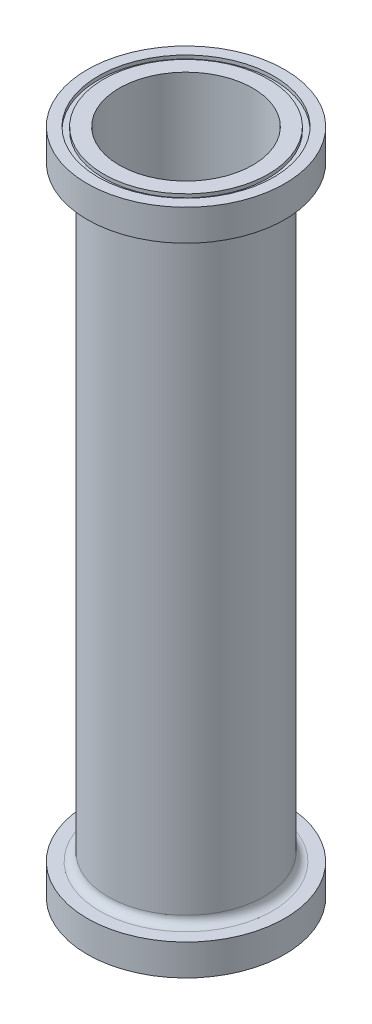
ISO-10303-21;
HEADER;
FILE_DESCRIPTION(('STEP AP214'),'2;1');
FILE_NAME('part.step','',(''),(''),'','','');
FILE_SCHEMA(('AUTOMOTIVE_DESIGN { 1 0 10303 214 1 1 1 1 }'));
ENDSEC;
DATA;
#1=APPLICATION_CONTEXT('core data for automotive mechanical design processes');
#2=APPLICATION_PROTOCOL_DEFINITION('international standard','automotive_design',2000,#1);
#3=PRODUCT_CONTEXT('',#1,'mechanical');
#4=PRODUCT('Part','Part','',(#3));
#5=PRODUCT_RELATED_PRODUCT_CATEGORY('part','',(#4));
#6=PRODUCT_DEFINITION_FORMATION('','',#4);
#7=PRODUCT_DEFINITION_CONTEXT('part definition',#1,'design');
#8=PRODUCT_DEFINITION('design','',#6,#7);
#9=PRODUCT_DEFINITION_SHAPE('','',#8);
#10=(LENGTH_UNIT() NAMED_UNIT(*) SI_UNIT(.MILLI.,.METRE.));
#11=(NAMED_UNIT(*) PLANE_ANGLE_UNIT() SI_UNIT($,.RADIAN.));
#12=(NAMED_UNIT(*) SI_UNIT($,.STERADIAN.) SOLID_ANGLE_UNIT());
#13=UNCERTAINTY_MEASURE_WITH_UNIT(LENGTH_MEASURE(1.E-05),#10,'distance_accuracy_value','');
#14=(GEOMETRIC_REPRESENTATION_CONTEXT(3) GLOBAL_UNCERTAINTY_ASSIGNED_CONTEXT((#13)) GLOBAL_UNIT_ASSIGNED_CONTEXT((#10,
#11,#12)) REPRESENTATION_CONTEXT('',''));
#15=CARTESIAN_POINT('',(0.,0.,0.));
#16=DIRECTION('',(0.,0.,1.));
#17=DIRECTION('',(1.,0.,0.));
#18=AXIS2_PLACEMENT_3D('',#15,#16,#17);
#19=CARTESIAN_POINT('',(0.,381.,0.));
#20=DIRECTION('',(0.,1.,0.));
#21=DIRECTION('',(0.,0.,1.));
#22=AXIS2_PLACEMENT_3D('',#19,#20,#21);
#23=PLANE('',#22);
#24=CARTESIAN_POINT('',(0.,381.,0.));
#25=DIRECTION('',(0.,1.,0.));
#26=DIRECTION('',(0.,0.,1.));
#27=AXIS2_PLACEMENT_3D('',#24,#25,#26);
#28=CIRCLE('',#27,38.1);
#29=CARTESIAN_POINT('',(0.,381.,38.1));
#30=VERTEX_POINT('',#29);
#31=EDGE_CURVE('E54',#30,#30,#28,.T.);
#32=ORIENTED_EDGE('',*,*,#31,.F.);
#33=EDGE_LOOP('',(#32));
#34=FACE_BOUND('',#33,.T.);
#35=CARTESIAN_POINT('',(0.,381.,0.));
#36=DIRECTION('',(0.,1.,0.));
#37=DIRECTION('',(0.,0.,1.));
#38=AXIS2_PLACEMENT_3D('',#35,#36,#37);
#39=CIRCLE('',#38,47.0027);
#40=CARTESIAN_POINT('',(0.,381.,47.0027));
#41=VERTEX_POINT('',#40);
#42=EDGE_CURVE('E91',#41,#41,#39,.T.);
#43=ORIENTED_EDGE('',*,*,#42,.T.);
#44=EDGE_LOOP('',(#43));
#45=FACE_BOUND('',#44,.T.);
#46=ADVANCED_FACE('F34',(#34,#45),#23,.T.);
#47=CARTESIAN_POINT('',(0.,0.,0.));
#48=DIRECTION('',(0.,1.,0.));
#49=DIRECTION('',(0.,0.,1.));
#50=AXIS2_PLACEMENT_3D('',#47,#48,#49);
#51=PLANE('',#50);
#52=CARTESIAN_POINT('',(0.,0.,0.));
#53=DIRECTION('',(0.,1.,0.));
#54=DIRECTION('',(0.,0.,1.));
#55=AXIS2_PLACEMENT_3D('',#52,#53,#54);
#56=CIRCLE('',#55,38.1);
#57=CARTESIAN_POINT('',(0.,0.,38.1));
#58=VERTEX_POINT('',#57);
#59=EDGE_CURVE('E55',#58,#58,#56,.T.);
#60=ORIENTED_EDGE('',*,*,#59,.T.);
#61=EDGE_LOOP('',(#60));
#62=FACE_BOUND('',#61,.T.);
#63=CARTESIAN_POINT('',(0.,0.,0.));
#64=DIRECTION('',(0.,-1.,0.));
#65=DIRECTION('',(0.,0.,-1.));
#66=AXIS2_PLACEMENT_3D('',#63,#64,#65);
#67=CIRCLE('',#66,47.0027);
#68=CARTESIAN_POINT('',(0.,0.,-47.0027));
#69=VERTEX_POINT('',#68);
#70=EDGE_CURVE('E79',#69,#69,#67,.T.);
#71=ORIENTED_EDGE('',*,*,#70,.T.);
#72=EDGE_LOOP('',(#71));
#73=FACE_BOUND('',#72,.T.);
#74=ADVANCED_FACE('F137',(#62,#73),#51,.F.);
#75=CARTESIAN_POINT('',(0.,381.,0.));
#76=DIRECTION('',(0.,-1.,0.));
#77=DIRECTION('',(0.,0.,-1.));
#78=AXIS2_PLACEMENT_3D('',#75,#76,#77);
#79=CYLINDRICAL_SURFACE('',#78,44.45);
#80=CARTESIAN_POINT('',(0.,22.5425,0.));
#81=DIRECTION('',(0.,-1.,0.));
#82=DIRECTION('',(0.,0.,-1.));
#83=AXIS2_PLACEMENT_3D('',#80,#81,#82);
#84=CIRCLE('',#83,44.45);
#85=CARTESIAN_POINT('',(0.,22.5425,-44.45));
#86=VERTEX_POINT('',#85);
#87=EDGE_CURVE('E41',#86,#86,#84,.F.);
#88=ORIENTED_EDGE('',*,*,#87,.T.);
#89=EDGE_LOOP('',(#88));
#90=FACE_BOUND('',#89,.T.);
#91=CARTESIAN_POINT('',(0.,358.4575,0.));
#92=DIRECTION('',(0.,1.,0.));
#93=DIRECTION('',(0.,0.,1.));
#94=AXIS2_PLACEMENT_3D('',#91,#92,#93);
#95=CIRCLE('',#94,44.45);
#96=CARTESIAN_POINT('',(0.,358.4575,44.45));
#97=VERTEX_POINT('',#96);
#98=EDGE_CURVE('E45',#97,#97,#95,.F.);
#99=ORIENTED_EDGE('',*,*,#98,.T.);
#100=EDGE_LOOP('',(#99));
#101=FACE_BOUND('',#100,.T.);
#102=ADVANCED_FACE('F117',(#90,#101),#79,.T.);
#103=CARTESIAN_POINT('',(0.,381.,0.));
#104=DIRECTION('',(0.,1.,0.));
#105=DIRECTION('',(0.,0.,1.));
#106=AXIS2_PLACEMENT_3D('',#103,#104,#105);
#107=CIRCLE('',#106,50.0761);
#108=CARTESIAN_POINT('',(0.,381.,50.0761));
#109=VERTEX_POINT('',#108);
#110=EDGE_CURVE('E85',#109,#109,#107,.T.);
#111=ORIENTED_EDGE('',*,*,#110,.F.);
#112=EDGE_LOOP('',(#111));
#113=FACE_BOUND('',#112,.T.);
#114=CARTESIAN_POINT('',(0.,381.,0.));
#115=DIRECTION('',(0.,1.,0.));
#116=DIRECTION('',(0.,0.,1.));
#117=AXIS2_PLACEMENT_3D('',#114,#115,#116);
#118=CIRCLE('',#117,56.388);
#119=CARTESIAN_POINT('',(0.,381.,56.388));
#120=VERTEX_POINT('',#119);
#121=EDGE_CURVE('E67',#120,#120,#118,.T.);
#122=ORIENTED_EDGE('',*,*,#121,.T.);
#123=EDGE_LOOP('',(#122));
#124=FACE_BOUND('',#123,.T.);
#125=ADVANCED_FACE('F113',(#113,#124),#23,.T.);
#126=CARTESIAN_POINT('',(0.,0.,0.));
#127=DIRECTION('',(0.,-1.,0.));
#128=DIRECTION('',(0.,0.,-1.));
#129=AXIS2_PLACEMENT_3D('',#126,#127,#128);
#130=CIRCLE('',#129,50.0761);
#131=CARTESIAN_POINT('',(0.,0.,-50.0761));
#132=VERTEX_POINT('',#131);
#133=EDGE_CURVE('E73',#132,#132,#130,.T.);
#134=ORIENTED_EDGE('',*,*,#133,.F.);
#135=EDGE_LOOP('',(#134));
#136=FACE_BOUND('',#135,.T.);
#137=CARTESIAN_POINT('',(0.,0.,0.));
#138=DIRECTION('',(0.,-1.,0.));
#139=DIRECTION('',(0.,0.,-1.));
#140=AXIS2_PLACEMENT_3D('',#137,#138,#139);
#141=CIRCLE('',#140,56.388);
#142=CARTESIAN_POINT('',(0.,0.,-56.388));
#143=VERTEX_POINT('',#142);
#144=EDGE_CURVE('E61',#143,#143,#141,.T.);
#145=ORIENTED_EDGE('',*,*,#144,.T.);
#146=EDGE_LOOP('',(#145));
#147=FACE_BOUND('',#146,.T.);
#148=ADVANCED_FACE('F116',(#136,#147),#51,.F.);
#149=CARTESIAN_POINT('',(0.,381.,0.));
#150=DIRECTION('',(0.,-1.,0.));
#151=DIRECTION('',(0.,0.,-1.));
#152=AXIS2_PLACEMENT_3D('',#149,#150,#151);
#153=CYLINDRICAL_SURFACE('',#152,38.1);
#154=ORIENTED_EDGE('',*,*,#31,.T.);
#155=EDGE_LOOP('',(#154));
#156=FACE_BOUND('',#155,.T.);
#157=ORIENTED_EDGE('',*,*,#59,.F.);
#158=EDGE_LOOP('',(#157));
#159=FACE_BOUND('',#158,.T.);
#160=ADVANCED_FACE('F147',(#156,#159),#153,.F.);
#161=CARTESIAN_POINT('',(0.,17.78,0.));
#162=DIRECTION('',(0.,-1.,0.));
#163=DIRECTION('',(0.,0.,-1.));
#164=AXIS2_PLACEMENT_3D('',#161,#162,#163);
#165=CYLINDRICAL_SURFACE('',#164,56.388);
#166=CARTESIAN_POINT('',(0.,17.78,0.));
#167=DIRECTION('',(0.,-1.,0.));
#168=DIRECTION('',(0.,0.,-1.));
#169=AXIS2_PLACEMENT_3D('',#166,#167,#168);
#170=CIRCLE('',#169,56.388);
#171=CARTESIAN_POINT('',(0.,17.78,-56.388));
#172=VERTEX_POINT('',#171);
#173=EDGE_CURVE('E58',#172,#172,#170,.T.);
#174=ORIENTED_EDGE('',*,*,#173,.T.);
#175=EDGE_LOOP('',(#174));
#176=FACE_BOUND('',#175,.T.);
#177=ORIENTED_EDGE('',*,*,#144,.F.);
#178=EDGE_LOOP('',(#177));
#179=FACE_BOUND('',#178,.T.);
#180=ADVANCED_FACE('F133',(#176,#179),#165,.T.);
#181=CARTESIAN_POINT('',(0.,17.78,0.));
#182=DIRECTION('',(0.,-1.,0.));
#183=DIRECTION('',(0.,0.,-1.));
#184=AXIS2_PLACEMENT_3D('',#181,#182,#183);
#185=PLANE('',#184);
#186=CARTESIAN_POINT('',(0.,17.78,0.));
#187=DIRECTION('',(0.,-1.,0.));
#188=DIRECTION('',(0.,0.,-1.));
#189=AXIS2_PLACEMENT_3D('',#186,#187,#188);
#190=CIRCLE('',#189,49.2125);
#191=CARTESIAN_POINT('',(0.,17.78,-49.2125));
#192=VERTEX_POINT('',#191);
#193=EDGE_CURVE('E49',#192,#192,#190,.T.);
#194=ORIENTED_EDGE('',*,*,#193,.T.);
#195=EDGE_LOOP('',(#194));
#196=FACE_BOUND('',#195,.T.);
#197=ORIENTED_EDGE('',*,*,#173,.F.);
#198=EDGE_LOOP('',(#197));
#199=FACE_BOUND('',#198,.T.);
#200=ADVANCED_FACE('F124',(#196,#199),#185,.F.);
#201=CARTESIAN_POINT('',(0.,363.22,0.));
#202=DIRECTION('',(0.,1.,0.));
#203=DIRECTION('',(0.,0.,1.));
#204=AXIS2_PLACEMENT_3D('',#201,#202,#203);
#205=CYLINDRICAL_SURFACE('',#204,56.388);
#206=CARTESIAN_POINT('',(0.,363.22,0.));
#207=DIRECTION('',(0.,1.,0.));
#208=DIRECTION('',(0.,0.,1.));
#209=AXIS2_PLACEMENT_3D('',#206,#207,#208);
#210=CIRCLE('',#209,56.388);
#211=CARTESIAN_POINT('',(0.,363.22,56.388));
#212=VERTEX_POINT('',#211);
#213=EDGE_CURVE('E64',#212,#212,#210,.T.);
#214=ORIENTED_EDGE('',*,*,#213,.T.);
#215=EDGE_LOOP('',(#214));
#216=FACE_BOUND('',#215,.T.);
#217=ORIENTED_EDGE('',*,*,#121,.F.);
#218=EDGE_LOOP('',(#217));
#219=FACE_BOUND('',#218,.T.);
#220=ADVANCED_FACE('F121',(#216,#219),#205,.T.);
#221=CARTESIAN_POINT('',(0.,363.22,0.));
#222=DIRECTION('',(0.,1.,0.));
#223=DIRECTION('',(0.,0.,1.));
#224=AXIS2_PLACEMENT_3D('',#221,#222,#223);
#225=PLANE('',#224);
#226=CARTESIAN_POINT('',(0.,363.22,0.));
#227=DIRECTION('',(0.,1.,0.));
#228=DIRECTION('',(0.,0.,1.));
#229=AXIS2_PLACEMENT_3D('',#226,#227,#228);
#230=CIRCLE('',#229,49.2125);
#231=CARTESIAN_POINT('',(0.,363.22,49.2125));
#232=VERTEX_POINT('',#231);
#233=EDGE_CURVE('E10',#232,#232,#230,.T.);
#234=ORIENTED_EDGE('',*,*,#233,.T.);
#235=EDGE_LOOP('',(#234));
#236=FACE_BOUND('',#235,.T.);
#237=ORIENTED_EDGE('',*,*,#213,.F.);
#238=EDGE_LOOP('',(#237));
#239=FACE_BOUND('',#238,.T.);
#240=ADVANCED_FACE('F123',(#236,#239),#225,.F.);
#241=CARTESIAN_POINT('',(0.,1.9812,0.));
#242=DIRECTION('',(0.,-1.,0.));
#243=DIRECTION('',(0.,0.,-1.));
#244=AXIS2_PLACEMENT_3D('',#241,#242,#243);
#245=CYLINDRICAL_SURFACE('',#244,50.0761);
#246=CARTESIAN_POINT('',(0.,1.9812,0.));
#247=DIRECTION('',(0.,-1.,0.));
#248=DIRECTION('',(0.,0.,-1.));
#249=AXIS2_PLACEMENT_3D('',#246,#247,#248);
#250=CIRCLE('',#249,50.0761);
#251=CARTESIAN_POINT('',(0.,1.9812,-50.0761));
#252=VERTEX_POINT('',#251);
#253=EDGE_CURVE('E70',#252,#252,#250,.T.);
#254=ORIENTED_EDGE('',*,*,#253,.F.);
#255=EDGE_LOOP('',(#254));
#256=FACE_BOUND('',#255,.T.);
#257=ORIENTED_EDGE('',*,*,#133,.T.);
#258=EDGE_LOOP('',(#257));
#259=FACE_BOUND('',#258,.T.);
#260=ADVANCED_FACE('F131',(#256,#259),#245,.F.);
#261=CARTESIAN_POINT('',(0.,1.9812,0.));
#262=DIRECTION('',(0.,-1.,0.));
#263=DIRECTION('',(0.,0.,-1.));
#264=AXIS2_PLACEMENT_3D('',#261,#262,#263);
#265=PLANE('',#264);
#266=CARTESIAN_POINT('',(0.,1.9812,0.));
#267=DIRECTION('',(0.,-1.,0.));
#268=DIRECTION('',(0.,0.,-1.));
#269=AXIS2_PLACEMENT_3D('',#266,#267,#268);
#270=CIRCLE('',#269,47.0027);
#271=CARTESIAN_POINT('',(0.,1.9812,-47.0027));
#272=VERTEX_POINT('',#271);
#273=EDGE_CURVE('E76',#272,#272,#270,.T.);
#274=ORIENTED_EDGE('',*,*,#273,.F.);
#275=EDGE_LOOP('',(#274));
#276=FACE_BOUND('',#275,.T.);
#277=ORIENTED_EDGE('',*,*,#253,.T.);
#278=EDGE_LOOP('',(#277));
#279=FACE_BOUND('',#278,.T.);
#280=ADVANCED_FACE('F183',(#276,#279),#265,.T.);
#281=CARTESIAN_POINT('',(0.,1.9812,0.));
#282=DIRECTION('',(0.,-1.,0.));
#283=DIRECTION('',(0.,0.,-1.));
#284=AXIS2_PLACEMENT_3D('',#281,#282,#283);
#285=CYLINDRICAL_SURFACE('',#284,47.0027);
#286=ORIENTED_EDGE('',*,*,#273,.T.);
#287=EDGE_LOOP('',(#286));
#288=FACE_BOUND('',#287,.T.);
#289=ORIENTED_EDGE('',*,*,#70,.F.);
#290=EDGE_LOOP('',(#289));
#291=FACE_BOUND('',#290,.T.);
#292=ADVANCED_FACE('F109',(#288,#291),#285,.T.);
#293=CARTESIAN_POINT('',(0.,379.0188,0.));
#294=DIRECTION('',(0.,1.,0.));
#295=DIRECTION('',(0.,0.,1.));
#296=AXIS2_PLACEMENT_3D('',#293,#294,#295);
#297=CYLINDRICAL_SURFACE('',#296,50.0761);
#298=CARTESIAN_POINT('',(0.,379.0188,0.));
#299=DIRECTION('',(0.,1.,0.));
#300=DIRECTION('',(0.,0.,1.));
#301=AXIS2_PLACEMENT_3D('',#298,#299,#300);
#302=CIRCLE('',#301,50.0761);
#303=CARTESIAN_POINT('',(0.,379.0188,50.0761));
#304=VERTEX_POINT('',#303);
#305=EDGE_CURVE('E82',#304,#304,#302,.T.);
#306=ORIENTED_EDGE('',*,*,#305,.F.);
#307=EDGE_LOOP('',(#306));
#308=FACE_BOUND('',#307,.T.);
#309=ORIENTED_EDGE('',*,*,#110,.T.);
#310=EDGE_LOOP('',(#309));
#311=FACE_BOUND('',#310,.T.);
#312=ADVANCED_FACE('F103',(#308,#311),#297,.F.);
#313=CARTESIAN_POINT('',(0.,379.0188,0.));
#314=DIRECTION('',(0.,1.,0.));
#315=DIRECTION('',(0.,0.,1.));
#316=AXIS2_PLACEMENT_3D('',#313,#314,#315);
#317=PLANE('',#316);
#318=CARTESIAN_POINT('',(0.,379.0188,0.));
#319=DIRECTION('',(0.,1.,0.));
#320=DIRECTION('',(0.,0.,1.));
#321=AXIS2_PLACEMENT_3D('',#318,#319,#320);
#322=CIRCLE('',#321,47.0027);
#323=CARTESIAN_POINT('',(0.,379.0188,47.0027));
#324=VERTEX_POINT('',#323);
#325=EDGE_CURVE('E88',#324,#324,#322,.T.);
#326=ORIENTED_EDGE('',*,*,#325,.F.);
#327=EDGE_LOOP('',(#326));
#328=FACE_BOUND('',#327,.T.);
#329=ORIENTED_EDGE('',*,*,#305,.T.);
#330=EDGE_LOOP('',(#329));
#331=FACE_BOUND('',#330,.T.);
#332=ADVANCED_FACE('F100',(#328,#331),#317,.T.);
#333=CARTESIAN_POINT('',(0.,379.0188,0.));
#334=DIRECTION('',(0.,1.,0.));
#335=DIRECTION('',(0.,0.,1.));
#336=AXIS2_PLACEMENT_3D('',#333,#334,#335);
#337=CYLINDRICAL_SURFACE('',#336,47.0027);
#338=ORIENTED_EDGE('',*,*,#325,.T.);
#339=EDGE_LOOP('',(#338));
#340=FACE_BOUND('',#339,.T.);
#341=ORIENTED_EDGE('',*,*,#42,.F.);
#342=EDGE_LOOP('',(#341));
#343=FACE_BOUND('',#342,.T.);
#344=ADVANCED_FACE('F97',(#340,#343),#337,.T.);
#345=CARTESIAN_POINT('',(0.,22.5425,0.));
#346=DIRECTION('',(0.,-1.,0.));
#347=DIRECTION('',(0.,0.,-1.));
#348=AXIS2_PLACEMENT_3D('',#345,#346,#347);
#349=TOROIDAL_SURFACE('',#348,49.2125,4.7625);
#350=ORIENTED_EDGE('',*,*,#87,.F.);
#351=EDGE_LOOP('',(#350));
#352=FACE_BOUND('',#351,.T.);
#353=ORIENTED_EDGE('',*,*,#193,.F.);
#354=EDGE_LOOP('',(#353));
#355=FACE_BOUND('',#354,.T.);
#356=ADVANCED_FACE('F153',(#352,#355),#349,.F.);
#357=CARTESIAN_POINT('',(0.,358.4575,0.));
#358=DIRECTION('',(0.,1.,0.));
#359=DIRECTION('',(0.,0.,1.));
#360=AXIS2_PLACEMENT_3D('',#357,#358,#359);
#361=TOROIDAL_SURFACE('',#360,49.2125,4.7625);
#362=ORIENTED_EDGE('',*,*,#98,.F.);
#363=EDGE_LOOP('',(#362));
#364=FACE_BOUND('',#363,.T.);
#365=ORIENTED_EDGE('',*,*,#233,.F.);
#366=EDGE_LOOP('',(#365));
#367=FACE_BOUND('',#366,.T.);
#368=ADVANCED_FACE('F36',(#364,#367),#361,.F.);
#369=CLOSED_SHELL('',(#46,#74,#102,#125,#148,#160,#180,#200,#220,#240,#260,#280,#292,#312,#332,
#344,#356,#368));
#370=MANIFOLD_SOLID_BREP('B2',#369);
#371=ADVANCED_BREP_SHAPE_REPRESENTATION('',(#18,#370),#14);
#372=SHAPE_DEFINITION_REPRESENTATION(#9,#371);
ENDSEC;
END-ISO-10303-21;
